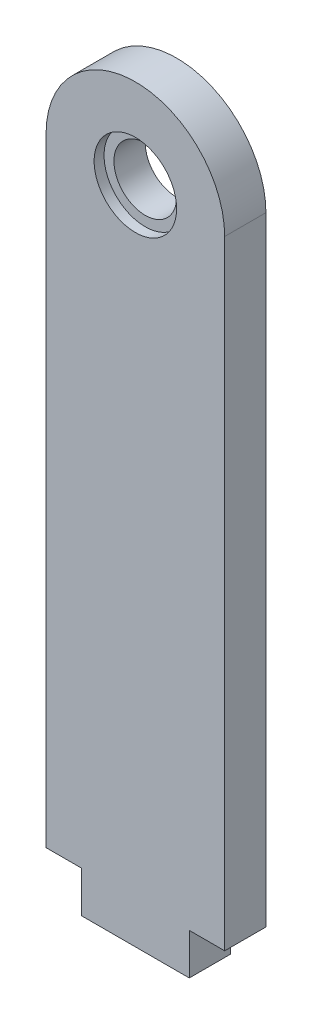
ISO-10303-21;
HEADER;
FILE_DESCRIPTION(('STEP AP214'),'2;1');
FILE_NAME('part.step','',(''),(''),'','','');
FILE_SCHEMA(('AUTOMOTIVE_DESIGN { 1 0 10303 214 1 1 1 1 }'));
ENDSEC;
DATA;
#1=APPLICATION_CONTEXT('core data for automotive mechanical design processes');
#2=APPLICATION_PROTOCOL_DEFINITION('international standard','automotive_design',2000,#1);
#3=PRODUCT_CONTEXT('',#1,'mechanical');
#4=PRODUCT('Part','Part','',(#3));
#5=PRODUCT_RELATED_PRODUCT_CATEGORY('part','',(#4));
#6=PRODUCT_DEFINITION_FORMATION('','',#4);
#7=PRODUCT_DEFINITION_CONTEXT('part definition',#1,'design');
#8=PRODUCT_DEFINITION('design','',#6,#7);
#9=PRODUCT_DEFINITION_SHAPE('','',#8);
#10=(LENGTH_UNIT() NAMED_UNIT(*) SI_UNIT(.MILLI.,.METRE.));
#11=(NAMED_UNIT(*) PLANE_ANGLE_UNIT() SI_UNIT($,.RADIAN.));
#12=(NAMED_UNIT(*) SI_UNIT($,.STERADIAN.) SOLID_ANGLE_UNIT());
#13=UNCERTAINTY_MEASURE_WITH_UNIT(LENGTH_MEASURE(1.E-05),#10,'distance_accuracy_value','');
#14=(GEOMETRIC_REPRESENTATION_CONTEXT(3) GLOBAL_UNCERTAINTY_ASSIGNED_CONTEXT((#13)) GLOBAL_UNIT_ASSIGNED_CONTEXT((#10,
#11,#12)) REPRESENTATION_CONTEXT('',''));
#15=CARTESIAN_POINT('',(0.,0.,0.));
#16=DIRECTION('',(0.,0.,1.));
#17=DIRECTION('',(1.,0.,0.));
#18=AXIS2_PLACEMENT_3D('',#15,#16,#17);
#19=CARTESIAN_POINT('',(13.75,95.25,6.35));
#20=DIRECTION('',(0.,0.,-1.));
#21=DIRECTION('',(-1.,0.,0.));
#22=AXIS2_PLACEMENT_3D('',#19,#20,#21);
#23=CYLINDRICAL_SURFACE('',#22,4.82599999999999);
#24=CARTESIAN_POINT('',(13.75,95.25,0.));
#25=DIRECTION('',(0.,0.,1.));
#26=DIRECTION('',(1.,0.,0.));
#27=AXIS2_PLACEMENT_3D('',#24,#25,#26);
#28=CIRCLE('',#27,4.82599999999999);
#29=CARTESIAN_POINT('',(18.576,95.25,0.));
#30=VERTEX_POINT('',#29);
#31=EDGE_CURVE('E138',#30,#30,#28,.T.);
#32=ORIENTED_EDGE('',*,*,#31,.F.);
#33=EDGE_LOOP('',(#32));
#34=FACE_BOUND('',#33,.T.);
#35=CARTESIAN_POINT('',(13.75,95.25,4.826));
#36=DIRECTION('',(0.,0.,1.));
#37=DIRECTION('',(1.,0.,0.));
#38=AXIS2_PLACEMENT_3D('',#35,#36,#37);
#39=CIRCLE('',#38,4.82599999999999);
#40=CARTESIAN_POINT('',(18.576,95.25,4.826));
#41=VERTEX_POINT('',#40);
#42=EDGE_CURVE('E224',#41,#41,#39,.F.);
#43=ORIENTED_EDGE('',*,*,#42,.F.);
#44=EDGE_LOOP('',(#43));
#45=FACE_BOUND('',#44,.T.);
#46=ADVANCED_FACE('F41',(#34,#45),#23,.F.);
#47=CARTESIAN_POINT('',(13.75,95.25,6.35));
#48=DIRECTION('',(0.,0.,-1.));
#49=DIRECTION('',(-1.,0.,0.));
#50=AXIS2_PLACEMENT_3D('',#47,#48,#49);
#51=CYLINDRICAL_SURFACE('',#50,13.75);
#52=CARTESIAN_POINT('',(13.75,95.25,0.));
#53=DIRECTION('',(0.,0.,1.));
#54=DIRECTION('',(1.,0.,0.));
#55=AXIS2_PLACEMENT_3D('',#52,#53,#54);
#56=CIRCLE('',#55,13.75);
#57=CARTESIAN_POINT('',(0.,95.25,0.));
#58=VERTEX_POINT('',#57);
#59=CARTESIAN_POINT('',(27.5,95.25,0.));
#60=VERTEX_POINT('',#59);
#61=EDGE_CURVE('E141',#58,#60,#56,.F.);
#62=ORIENTED_EDGE('',*,*,#61,.F.);
#63=DIRECTION('',(0.,0.,-1.));
#64=VECTOR('',#63,1.);
#65=CARTESIAN_POINT('',(0.,95.25,6.35));
#66=LINE('',#65,#64);
#67=CARTESIAN_POINT('',(0.,95.25,6.35));
#68=VERTEX_POINT('',#67);
#69=EDGE_CURVE('E12',#68,#58,#66,.T.);
#70=ORIENTED_EDGE('',*,*,#69,.F.);
#71=CARTESIAN_POINT('',(13.75,95.25,6.35));
#72=DIRECTION('',(0.,0.,1.));
#73=DIRECTION('',(1.,0.,0.));
#74=AXIS2_PLACEMENT_3D('',#71,#72,#73);
#75=CIRCLE('',#74,13.75);
#76=CARTESIAN_POINT('',(27.5,95.25,6.35));
#77=VERTEX_POINT('',#76);
#78=EDGE_CURVE('E159',#68,#77,#75,.F.);
#79=ORIENTED_EDGE('',*,*,#78,.T.);
#80=DIRECTION('',(0.,0.,-1.));
#81=VECTOR('',#80,1.);
#82=CARTESIAN_POINT('',(27.5,95.25,6.35));
#83=LINE('',#82,#81);
#84=EDGE_CURVE('E92',#77,#60,#83,.T.);
#85=ORIENTED_EDGE('',*,*,#84,.T.);
#86=EDGE_LOOP('',(#62,#70,#79,#85));
#87=FACE_BOUND('',#86,.T.);
#88=ADVANCED_FACE('F181',(#87),#51,.T.);
#89=CARTESIAN_POINT('',(0.,0.,6.35));
#90=DIRECTION('',(-1.,0.,0.));
#91=DIRECTION('',(0.,0.,1.));
#92=AXIS2_PLACEMENT_3D('',#89,#90,#91);
#93=PLANE('',#92);
#94=DIRECTION('',(0.,1.,0.));
#95=VECTOR('',#94,1.);
#96=CARTESIAN_POINT('',(0.,0.,0.));
#97=LINE('',#96,#95);
#98=CARTESIAN_POINT('',(0.,0.,0.));
#99=VERTEX_POINT('',#98);
#100=EDGE_CURVE('E144',#99,#58,#97,.T.);
#101=ORIENTED_EDGE('',*,*,#100,.F.);
#102=DIRECTION('',(0.,0.,-1.));
#103=VECTOR('',#102,1.);
#104=CARTESIAN_POINT('',(0.,0.,6.35));
#105=LINE('',#104,#103);
#106=CARTESIAN_POINT('',(0.,0.,6.35));
#107=VERTEX_POINT('',#106);
#108=EDGE_CURVE('E49',#107,#99,#105,.T.);
#109=ORIENTED_EDGE('',*,*,#108,.F.);
#110=DIRECTION('',(0.,1.,0.));
#111=VECTOR('',#110,1.);
#112=CARTESIAN_POINT('',(0.,0.,6.35));
#113=LINE('',#112,#111);
#114=EDGE_CURVE('E180',#107,#68,#113,.T.);
#115=ORIENTED_EDGE('',*,*,#114,.T.);
#116=ORIENTED_EDGE('',*,*,#69,.T.);
#117=EDGE_LOOP('',(#101,#109,#115,#116));
#118=FACE_BOUND('',#117,.T.);
#119=ADVANCED_FACE('F179',(#118),#93,.T.);
#120=CARTESIAN_POINT('',(0.,0.,6.35));
#121=DIRECTION('',(0.,1.,0.));
#122=DIRECTION('',(-1.,0.,0.));
#123=AXIS2_PLACEMENT_3D('',#120,#121,#122);
#124=PLANE('',#123);
#125=DIRECTION('',(1.,0.,0.));
#126=VECTOR('',#125,1.);
#127=CARTESIAN_POINT('',(0.,0.,0.));
#128=LINE('',#127,#126);
#129=CARTESIAN_POINT('',(5.44950550834156,0.,0.));
#130=VERTEX_POINT('',#129);
#131=EDGE_CURVE('E147',#99,#130,#128,.T.);
#132=ORIENTED_EDGE('',*,*,#131,.T.);
#133=DIRECTION('',(0.,0.,-1.));
#134=VECTOR('',#133,1.);
#135=CARTESIAN_POINT('',(5.44950550834156,0.,6.35));
#136=LINE('',#135,#134);
#137=CARTESIAN_POINT('',(5.44950550834156,0.,6.35));
#138=VERTEX_POINT('',#137);
#139=EDGE_CURVE('E166',#138,#130,#136,.T.);
#140=ORIENTED_EDGE('',*,*,#139,.F.);
#141=DIRECTION('',(1.,0.,0.));
#142=VECTOR('',#141,1.);
#143=CARTESIAN_POINT('',(0.,0.,6.35));
#144=LINE('',#143,#142);
#145=EDGE_CURVE('E127',#107,#138,#144,.T.);
#146=ORIENTED_EDGE('',*,*,#145,.F.);
#147=ORIENTED_EDGE('',*,*,#108,.T.);
#148=EDGE_LOOP('',(#132,#140,#146,#147));
#149=FACE_BOUND('',#148,.T.);
#150=ADVANCED_FACE('F171',(#149),#124,.F.);
#151=CARTESIAN_POINT('',(5.44950550834156,0.,6.35));
#152=DIRECTION('',(1.,0.,0.));
#153=DIRECTION('',(0.,1.,0.));
#154=AXIS2_PLACEMENT_3D('',#151,#152,#153);
#155=PLANE('',#154);
#156=DIRECTION('',(0.,-1.,0.));
#157=VECTOR('',#156,1.);
#158=CARTESIAN_POINT('',(5.44950550834156,0.,0.));
#159=LINE('',#158,#157);
#160=CARTESIAN_POINT('',(5.44950550834156,-6.35,0.));
#161=VERTEX_POINT('',#160);
#162=EDGE_CURVE('E150',#130,#161,#159,.T.);
#163=ORIENTED_EDGE('',*,*,#162,.T.);
#164=DIRECTION('',(0.,0.,-1.));
#165=VECTOR('',#164,1.);
#166=CARTESIAN_POINT('',(5.44950550834156,-6.35,6.35));
#167=LINE('',#166,#165);
#168=CARTESIAN_POINT('',(5.44950550834156,-6.35,6.35));
#169=VERTEX_POINT('',#168);
#170=EDGE_CURVE('E163',#169,#161,#167,.T.);
#171=ORIENTED_EDGE('',*,*,#170,.F.);
#172=DIRECTION('',(0.,-1.,0.));
#173=VECTOR('',#172,1.);
#174=CARTESIAN_POINT('',(5.44950550834156,0.,6.35));
#175=LINE('',#174,#173);
#176=EDGE_CURVE('E133',#138,#169,#175,.T.);
#177=ORIENTED_EDGE('',*,*,#176,.F.);
#178=ORIENTED_EDGE('',*,*,#139,.T.);
#179=EDGE_LOOP('',(#163,#171,#177,#178));
#180=FACE_BOUND('',#179,.T.);
#181=ADVANCED_FACE('F190',(#180),#155,.F.);
#182=CARTESIAN_POINT('',(0.,-6.35,6.35));
#183=DIRECTION('',(0.,1.,0.));
#184=DIRECTION('',(-1.,0.,0.));
#185=AXIS2_PLACEMENT_3D('',#182,#183,#184);
#186=PLANE('',#185);
#187=DIRECTION('',(1.,0.,0.));
#188=VECTOR('',#187,1.);
#189=CARTESIAN_POINT('',(0.,-6.35,0.));
#190=LINE('',#189,#188);
#191=CARTESIAN_POINT('',(22.0504944916584,-6.35,0.));
#192=VERTEX_POINT('',#191);
#193=EDGE_CURVE('E154',#161,#192,#190,.T.);
#194=ORIENTED_EDGE('',*,*,#193,.T.);
#195=DIRECTION('',(0.,0.,-1.));
#196=VECTOR('',#195,1.);
#197=CARTESIAN_POINT('',(22.0504944916584,-6.35,6.35));
#198=LINE('',#197,#196);
#199=CARTESIAN_POINT('',(22.0504944916584,-6.35,6.35));
#200=VERTEX_POINT('',#199);
#201=EDGE_CURVE('E120',#200,#192,#198,.T.);
#202=ORIENTED_EDGE('',*,*,#201,.F.);
#203=DIRECTION('',(1.,0.,0.));
#204=VECTOR('',#203,1.);
#205=CARTESIAN_POINT('',(0.,-6.35,6.35));
#206=LINE('',#205,#204);
#207=EDGE_CURVE('E130',#169,#200,#206,.T.);
#208=ORIENTED_EDGE('',*,*,#207,.F.);
#209=ORIENTED_EDGE('',*,*,#170,.T.);
#210=EDGE_LOOP('',(#194,#202,#208,#209));
#211=FACE_BOUND('',#210,.T.);
#212=ADVANCED_FACE('F193',(#211),#186,.F.);
#213=CARTESIAN_POINT('',(22.0504944916584,0.,6.35));
#214=DIRECTION('',(1.,0.,0.));
#215=DIRECTION('',(0.,0.,-1.));
#216=AXIS2_PLACEMENT_3D('',#213,#214,#215);
#217=PLANE('',#216);
#218=DIRECTION('',(0.,-1.,0.));
#219=VECTOR('',#218,1.);
#220=CARTESIAN_POINT('',(22.0504944916584,0.,0.));
#221=LINE('',#220,#219);
#222=CARTESIAN_POINT('',(22.0504944916584,0.,0.));
#223=VERTEX_POINT('',#222);
#224=EDGE_CURVE('E117',#223,#192,#221,.T.);
#225=ORIENTED_EDGE('',*,*,#224,.F.);
#226=DIRECTION('',(0.,0.,-1.));
#227=VECTOR('',#226,1.);
#228=CARTESIAN_POINT('',(22.0504944916584,0.,6.35));
#229=LINE('',#228,#227);
#230=CARTESIAN_POINT('',(22.0504944916584,0.,6.35));
#231=VERTEX_POINT('',#230);
#232=EDGE_CURVE('E111',#231,#223,#229,.T.);
#233=ORIENTED_EDGE('',*,*,#232,.F.);
#234=DIRECTION('',(0.,-1.,0.));
#235=VECTOR('',#234,1.);
#236=CARTESIAN_POINT('',(22.0504944916584,0.,6.35));
#237=LINE('',#236,#235);
#238=EDGE_CURVE('E115',#231,#200,#237,.T.);
#239=ORIENTED_EDGE('',*,*,#238,.T.);
#240=ORIENTED_EDGE('',*,*,#201,.T.);
#241=EDGE_LOOP('',(#225,#233,#239,#240));
#242=FACE_BOUND('',#241,.T.);
#243=ADVANCED_FACE('F113',(#242),#217,.T.);
#244=CARTESIAN_POINT('',(27.5,0.,0.));
#245=VERTEX_POINT('',#244);
#246=EDGE_CURVE('E151',#223,#245,#128,.T.);
#247=ORIENTED_EDGE('',*,*,#246,.T.);
#248=DIRECTION('',(0.,0.,-1.));
#249=VECTOR('',#248,1.);
#250=CARTESIAN_POINT('',(27.5,0.,6.35));
#251=LINE('',#250,#249);
#252=CARTESIAN_POINT('',(27.5,0.,6.35));
#253=VERTEX_POINT('',#252);
#254=EDGE_CURVE('E121',#253,#245,#251,.T.);
#255=ORIENTED_EDGE('',*,*,#254,.F.);
#256=EDGE_CURVE('E124',#231,#253,#144,.T.);
#257=ORIENTED_EDGE('',*,*,#256,.F.);
#258=ORIENTED_EDGE('',*,*,#232,.T.);
#259=EDGE_LOOP('',(#247,#255,#257,#258));
#260=FACE_BOUND('',#259,.T.);
#261=ADVANCED_FACE('F125',(#260),#124,.F.);
#262=CARTESIAN_POINT('',(27.5,0.,6.35));
#263=DIRECTION('',(-1.,0.,0.));
#264=DIRECTION('',(0.,-1.,0.));
#265=AXIS2_PLACEMENT_3D('',#262,#263,#264);
#266=PLANE('',#265);
#267=DIRECTION('',(0.,1.,0.));
#268=VECTOR('',#267,1.);
#269=CARTESIAN_POINT('',(27.5,0.,0.));
#270=LINE('',#269,#268);
#271=EDGE_CURVE('E85',#245,#60,#270,.T.);
#272=ORIENTED_EDGE('',*,*,#271,.T.);
#273=ORIENTED_EDGE('',*,*,#84,.F.);
#274=DIRECTION('',(0.,1.,0.));
#275=VECTOR('',#274,1.);
#276=CARTESIAN_POINT('',(27.5,0.,6.35));
#277=LINE('',#276,#275);
#278=EDGE_CURVE('E57',#253,#77,#277,.T.);
#279=ORIENTED_EDGE('',*,*,#278,.F.);
#280=ORIENTED_EDGE('',*,*,#254,.T.);
#281=EDGE_LOOP('',(#272,#273,#279,#280));
#282=FACE_BOUND('',#281,.T.);
#283=ADVANCED_FACE('F202',(#282),#266,.F.);
#284=CARTESIAN_POINT('',(0.,0.,6.35));
#285=DIRECTION('',(0.,0.,1.));
#286=DIRECTION('',(1.,0.,0.));
#287=AXIS2_PLACEMENT_3D('',#284,#285,#286);
#288=PLANE('',#287);
#289=CARTESIAN_POINT('',(13.75,95.25,6.35));
#290=DIRECTION('',(0.,0.,1.));
#291=DIRECTION('',(1.,0.,0.));
#292=AXIS2_PLACEMENT_3D('',#289,#290,#291);
#293=CIRCLE('',#292,6.35);
#294=CARTESIAN_POINT('',(20.1,95.25,6.35));
#295=VERTEX_POINT('',#294);
#296=EDGE_CURVE('E228',#295,#295,#293,.T.);
#297=ORIENTED_EDGE('',*,*,#296,.F.);
#298=EDGE_LOOP('',(#297));
#299=FACE_BOUND('',#298,.T.);
#300=ORIENTED_EDGE('',*,*,#78,.F.);
#301=ORIENTED_EDGE('',*,*,#114,.F.);
#302=ORIENTED_EDGE('',*,*,#145,.T.);
#303=ORIENTED_EDGE('',*,*,#176,.T.);
#304=ORIENTED_EDGE('',*,*,#207,.T.);
#305=ORIENTED_EDGE('',*,*,#238,.F.);
#306=ORIENTED_EDGE('',*,*,#256,.T.);
#307=ORIENTED_EDGE('',*,*,#278,.T.);
#308=EDGE_LOOP('',(#300,#301,#302,#303,#304,#305,#306,#307));
#309=FACE_BOUND('',#308,.T.);
#310=ADVANCED_FACE('F128',(#299,#309),#288,.T.);
#311=CARTESIAN_POINT('',(0.,0.,0.));
#312=DIRECTION('',(0.,0.,1.));
#313=DIRECTION('',(1.,0.,0.));
#314=AXIS2_PLACEMENT_3D('',#311,#312,#313);
#315=PLANE('',#314);
#316=ORIENTED_EDGE('',*,*,#31,.T.);
#317=EDGE_LOOP('',(#316));
#318=FACE_BOUND('',#317,.T.);
#319=ORIENTED_EDGE('',*,*,#61,.T.);
#320=ORIENTED_EDGE('',*,*,#271,.F.);
#321=ORIENTED_EDGE('',*,*,#246,.F.);
#322=ORIENTED_EDGE('',*,*,#224,.T.);
#323=ORIENTED_EDGE('',*,*,#193,.F.);
#324=ORIENTED_EDGE('',*,*,#162,.F.);
#325=ORIENTED_EDGE('',*,*,#131,.F.);
#326=ORIENTED_EDGE('',*,*,#100,.T.);
#327=EDGE_LOOP('',(#319,#320,#321,#322,#323,#324,#325,#326));
#328=FACE_BOUND('',#327,.T.);
#329=ADVANCED_FACE('F178',(#318,#328),#315,.F.);
#330=CARTESIAN_POINT('',(13.75,95.25,4.826));
#331=DIRECTION('',(0.,0.,1.));
#332=DIRECTION('',(1.,0.,0.));
#333=AXIS2_PLACEMENT_3D('',#330,#331,#332);
#334=CYLINDRICAL_SURFACE('',#333,6.35);
#335=CARTESIAN_POINT('',(13.75,95.25,4.826));
#336=DIRECTION('',(0.,0.,1.));
#337=DIRECTION('',(1.,0.,0.));
#338=AXIS2_PLACEMENT_3D('',#335,#336,#337);
#339=CIRCLE('',#338,6.35);
#340=CARTESIAN_POINT('',(20.1,95.25,4.826));
#341=VERTEX_POINT('',#340);
#342=EDGE_CURVE('E142',#341,#341,#339,.T.);
#343=ORIENTED_EDGE('',*,*,#342,.F.);
#344=EDGE_LOOP('',(#343));
#345=FACE_BOUND('',#344,.T.);
#346=ORIENTED_EDGE('',*,*,#296,.T.);
#347=EDGE_LOOP('',(#346));
#348=FACE_BOUND('',#347,.T.);
#349=ADVANCED_FACE('F208',(#345,#348),#334,.F.);
#350=CARTESIAN_POINT('',(0.,0.,4.826));
#351=DIRECTION('',(0.,0.,1.));
#352=DIRECTION('',(1.,0.,0.));
#353=AXIS2_PLACEMENT_3D('',#350,#351,#352);
#354=PLANE('',#353);
#355=ORIENTED_EDGE('',*,*,#42,.T.);
#356=EDGE_LOOP('',(#355));
#357=FACE_BOUND('',#356,.T.);
#358=ORIENTED_EDGE('',*,*,#342,.T.);
#359=EDGE_LOOP('',(#358));
#360=FACE_BOUND('',#359,.T.);
#361=ADVANCED_FACE('F215',(#357,#360),#354,.T.);
#362=CLOSED_SHELL('',(#46,#88,#119,#150,#181,#212,#243,#261,#283,#310,#329,#349,#361));
#363=MANIFOLD_SOLID_BREP('B2',#362);
#364=ADVANCED_BREP_SHAPE_REPRESENTATION('',(#18,#363),#14);
#365=SHAPE_DEFINITION_REPRESENTATION(#9,#364);
ENDSEC;
END-ISO-10303-21;
